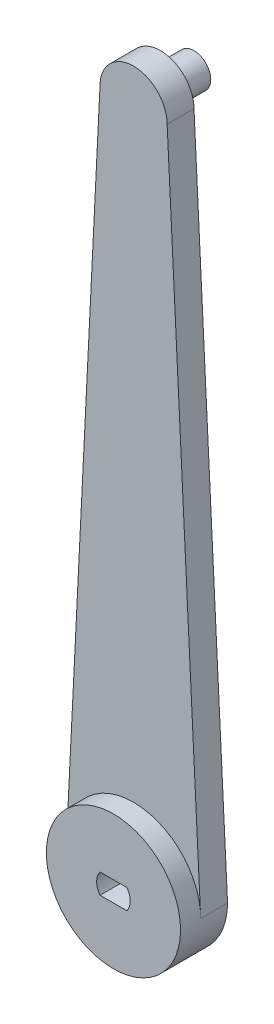
ISO-10303-21;
HEADER;
FILE_DESCRIPTION(('STEP AP214'),'2;1');
FILE_NAME('part.step','',(''),(''),'','','');
FILE_SCHEMA(('AUTOMOTIVE_DESIGN { 1 0 10303 214 1 1 1 1 }'));
ENDSEC;
DATA;
#1=APPLICATION_CONTEXT('core data for automotive mechanical design processes');
#2=APPLICATION_PROTOCOL_DEFINITION('international standard','automotive_design',2000,#1);
#3=PRODUCT_CONTEXT('',#1,'mechanical');
#4=PRODUCT('Part','Part','',(#3));
#5=PRODUCT_RELATED_PRODUCT_CATEGORY('part','',(#4));
#6=PRODUCT_DEFINITION_FORMATION('','',#4);
#7=PRODUCT_DEFINITION_CONTEXT('part definition',#1,'design');
#8=PRODUCT_DEFINITION('design','',#6,#7);
#9=PRODUCT_DEFINITION_SHAPE('','',#8);
#10=(LENGTH_UNIT() NAMED_UNIT(*) SI_UNIT(.MILLI.,.METRE.));
#11=(NAMED_UNIT(*) PLANE_ANGLE_UNIT() SI_UNIT($,.RADIAN.));
#12=(NAMED_UNIT(*) SI_UNIT($,.STERADIAN.) SOLID_ANGLE_UNIT());
#13=UNCERTAINTY_MEASURE_WITH_UNIT(LENGTH_MEASURE(1.E-05),#10,'distance_accuracy_value','');
#14=(GEOMETRIC_REPRESENTATION_CONTEXT(3) GLOBAL_UNCERTAINTY_ASSIGNED_CONTEXT((#13)) GLOBAL_UNIT_ASSIGNED_CONTEXT((#10,
#11,#12)) REPRESENTATION_CONTEXT('',''));
#15=CARTESIAN_POINT('',(0.,0.,0.));
#16=DIRECTION('',(0.,0.,1.));
#17=DIRECTION('',(1.,0.,0.));
#18=AXIS2_PLACEMENT_3D('',#15,#16,#17);
#19=CARTESIAN_POINT('',(0.,0.,0.));
#20=DIRECTION('',(0.,0.,1.));
#21=DIRECTION('',(1.,0.,0.));
#22=AXIS2_PLACEMENT_3D('',#19,#20,#21);
#23=PLANE('',#22);
#24=CARTESIAN_POINT('',(0.,100.,0.));
#25=DIRECTION('',(0.,0.,1.));
#26=DIRECTION('',(1.,0.,0.));
#27=AXIS2_PLACEMENT_3D('',#24,#25,#26);
#28=CIRCLE('',#27,2.5);
#29=CARTESIAN_POINT('',(2.5,100.,0.));
#30=VERTEX_POINT('',#29);
#31=EDGE_CURVE('E138',#30,#30,#28,.T.);
#32=ORIENTED_EDGE('',*,*,#31,.T.);
#33=EDGE_LOOP('',(#32));
#34=FACE_BOUND('',#33,.T.);
#35=CARTESIAN_POINT('',(0.,0.,0.));
#36=DIRECTION('',(0.,0.,1.));
#37=DIRECTION('',(1.,0.,0.));
#38=AXIS2_PLACEMENT_3D('',#35,#36,#37);
#39=CIRCLE('',#38,10.);
#40=CARTESIAN_POINT('',(-10.,0.,0.));
#41=VERTEX_POINT('',#40);
#42=CARTESIAN_POINT('',(10.,0.,0.));
#43=VERTEX_POINT('',#42);
#44=EDGE_CURVE('E161',#41,#43,#39,.T.);
#45=ORIENTED_EDGE('',*,*,#44,.F.);
#46=DIRECTION('',(-0.0499376169438922,-0.998752338877845,0.));
#47=VECTOR('',#46,1.);
#48=CARTESIAN_POINT('',(-10.,0.,0.));
#49=LINE('',#48,#47);
#50=CARTESIAN_POINT('',(-5.,100.,0.));
#51=VERTEX_POINT('',#50);
#52=EDGE_CURVE('E190',#51,#41,#49,.T.);
#53=ORIENTED_EDGE('',*,*,#52,.F.);
#54=CARTESIAN_POINT('',(0.,100.,0.));
#55=DIRECTION('',(0.,0.,1.));
#56=DIRECTION('',(1.,0.,0.));
#57=AXIS2_PLACEMENT_3D('',#54,#55,#56);
#58=CIRCLE('',#57,5.);
#59=CARTESIAN_POINT('',(5.,100.,0.));
#60=VERTEX_POINT('',#59);
#61=EDGE_CURVE('E187',#60,#51,#58,.T.);
#62=ORIENTED_EDGE('',*,*,#61,.F.);
#63=DIRECTION('',(-0.0499376169438922,0.998752338877845,0.));
#64=VECTOR('',#63,1.);
#65=CARTESIAN_POINT('',(5.,100.,0.));
#66=LINE('',#65,#64);
#67=EDGE_CURVE('E184',#43,#60,#66,.T.);
#68=ORIENTED_EDGE('',*,*,#67,.F.);
#69=EDGE_LOOP('',(#45,#53,#62,#68));
#70=FACE_BOUND('',#69,.T.);
#71=CARTESIAN_POINT('',(0.,0.,0.));
#72=DIRECTION('',(0.,0.,1.));
#73=DIRECTION('',(1.,0.,0.));
#74=AXIS2_PLACEMENT_3D('',#71,#72,#73);
#75=CIRCLE('',#74,2.5);
#76=CARTESIAN_POINT('',(-2.,1.5,0.));
#77=VERTEX_POINT('',#76);
#78=CARTESIAN_POINT('',(-2.,-1.5,0.));
#79=VERTEX_POINT('',#78);
#80=EDGE_CURVE('E61',#77,#79,#75,.T.);
#81=ORIENTED_EDGE('',*,*,#80,.T.);
#82=DIRECTION('',(1.,0.,0.));
#83=VECTOR('',#82,1.);
#84=CARTESIAN_POINT('',(-2.,-1.5,0.));
#85=LINE('',#84,#83);
#86=CARTESIAN_POINT('',(2.,-1.5,0.));
#87=VERTEX_POINT('',#86);
#88=EDGE_CURVE('E126',#79,#87,#85,.T.);
#89=ORIENTED_EDGE('',*,*,#88,.T.);
#90=CARTESIAN_POINT('',(0.,0.,0.));
#91=DIRECTION('',(0.,0.,1.));
#92=DIRECTION('',(1.,0.,0.));
#93=AXIS2_PLACEMENT_3D('',#90,#91,#92);
#94=CIRCLE('',#93,2.5);
#95=CARTESIAN_POINT('',(2.,1.5,0.));
#96=VERTEX_POINT('',#95);
#97=EDGE_CURVE('E133',#87,#96,#94,.T.);
#98=ORIENTED_EDGE('',*,*,#97,.T.);
#99=DIRECTION('',(-1.,0.,0.));
#100=VECTOR('',#99,1.);
#101=CARTESIAN_POINT('',(-2.,1.5,0.));
#102=LINE('',#101,#100);
#103=EDGE_CURVE('E136',#96,#77,#102,.T.);
#104=ORIENTED_EDGE('',*,*,#103,.T.);
#105=EDGE_LOOP('',(#81,#89,#98,#104));
#106=FACE_BOUND('',#105,.T.);
#107=ADVANCED_FACE('F45',(#34,#70,#106),#23,.F.);
#108=CARTESIAN_POINT('',(0.,0.,7.));
#109=DIRECTION('',(0.,0.,1.));
#110=DIRECTION('',(1.,0.,0.));
#111=AXIS2_PLACEMENT_3D('',#108,#109,#110);
#112=PLANE('',#111);
#113=CARTESIAN_POINT('',(0.,0.,7.));
#114=DIRECTION('',(0.,0.,1.));
#115=DIRECTION('',(1.,0.,0.));
#116=AXIS2_PLACEMENT_3D('',#113,#114,#115);
#117=CIRCLE('',#116,10.);
#118=CARTESIAN_POINT('',(10.,0.,7.));
#119=VERTEX_POINT('',#118);
#120=EDGE_CURVE('E157',#119,#119,#117,.T.);
#121=ORIENTED_EDGE('',*,*,#120,.T.);
#122=EDGE_LOOP('',(#121));
#123=FACE_BOUND('',#122,.T.);
#124=DIRECTION('',(-1.,0.,0.));
#125=VECTOR('',#124,1.);
#126=CARTESIAN_POINT('',(0.,-1.5,7.));
#127=LINE('',#126,#125);
#128=CARTESIAN_POINT('',(2.,-1.5,7.));
#129=VERTEX_POINT('',#128);
#130=CARTESIAN_POINT('',(-2.,-1.5,7.));
#131=VERTEX_POINT('',#130);
#132=EDGE_CURVE('E54',#129,#131,#127,.T.);
#133=ORIENTED_EDGE('',*,*,#132,.T.);
#134=CARTESIAN_POINT('',(0.,0.,7.));
#135=DIRECTION('',(0.,0.,1.));
#136=DIRECTION('',(1.,0.,0.));
#137=AXIS2_PLACEMENT_3D('',#134,#135,#136);
#138=CIRCLE('',#137,2.5);
#139=CARTESIAN_POINT('',(-2.,1.5,7.));
#140=VERTEX_POINT('',#139);
#141=EDGE_CURVE('E11',#131,#140,#138,.F.);
#142=ORIENTED_EDGE('',*,*,#141,.T.);
#143=DIRECTION('',(1.,0.,0.));
#144=VECTOR('',#143,1.);
#145=CARTESIAN_POINT('',(0.,1.5,7.));
#146=LINE('',#145,#144);
#147=CARTESIAN_POINT('',(2.,1.5,7.));
#148=VERTEX_POINT('',#147);
#149=EDGE_CURVE('E208',#140,#148,#146,.T.);
#150=ORIENTED_EDGE('',*,*,#149,.T.);
#151=CARTESIAN_POINT('',(0.,0.,7.));
#152=DIRECTION('',(0.,0.,1.));
#153=DIRECTION('',(1.,0.,0.));
#154=AXIS2_PLACEMENT_3D('',#151,#152,#153);
#155=CIRCLE('',#154,2.5);
#156=EDGE_CURVE('E212',#148,#129,#155,.F.);
#157=ORIENTED_EDGE('',*,*,#156,.T.);
#158=EDGE_LOOP('',(#133,#142,#150,#157));
#159=FACE_BOUND('',#158,.T.);
#160=ADVANCED_FACE('F217',(#123,#159),#112,.T.);
#161=CARTESIAN_POINT('',(0.,0.,4.));
#162=DIRECTION('',(0.,0.,-1.));
#163=DIRECTION('',(-1.,0.,0.));
#164=AXIS2_PLACEMENT_3D('',#161,#162,#163);
#165=CYLINDRICAL_SURFACE('',#164,10.);
#166=ORIENTED_EDGE('',*,*,#44,.T.);
#167=DIRECTION('',(0.,0.,-1.));
#168=VECTOR('',#167,1.);
#169=CARTESIAN_POINT('',(10.,0.,4.));
#170=LINE('',#169,#168);
#171=CARTESIAN_POINT('',(10.,0.,4.));
#172=VERTEX_POINT('',#171);
#173=EDGE_CURVE('E204',#172,#43,#170,.T.);
#174=ORIENTED_EDGE('',*,*,#173,.F.);
#175=CARTESIAN_POINT('',(0.,0.,4.));
#176=DIRECTION('',(0.,0.,1.));
#177=DIRECTION('',(1.,0.,0.));
#178=AXIS2_PLACEMENT_3D('',#175,#176,#177);
#179=CIRCLE('',#178,10.);
#180=CARTESIAN_POINT('',(9.9501246882793,0.997506234414003,4.));
#181=VERTEX_POINT('',#180);
#182=EDGE_CURVE('E162',#172,#181,#179,.T.);
#183=ORIENTED_EDGE('',*,*,#182,.T.);
#184=CARTESIAN_POINT('',(-9.9501246882793,0.997506234414003,4.));
#185=VERTEX_POINT('',#184);
#186=EDGE_CURVE('E166',#181,#185,#179,.T.);
#187=ORIENTED_EDGE('',*,*,#186,.T.);
#188=CARTESIAN_POINT('',(-10.,0.,4.));
#189=VERTEX_POINT('',#188);
#190=EDGE_CURVE('E122',#185,#189,#179,.T.);
#191=ORIENTED_EDGE('',*,*,#190,.T.);
#192=DIRECTION('',(0.,0.,-1.));
#193=VECTOR('',#192,1.);
#194=CARTESIAN_POINT('',(-10.,0.,4.));
#195=LINE('',#194,#193);
#196=EDGE_CURVE('E180',#189,#41,#195,.T.);
#197=ORIENTED_EDGE('',*,*,#196,.T.);
#198=EDGE_LOOP('',(#166,#174,#183,#187,#191,#197));
#199=FACE_BOUND('',#198,.T.);
#200=ORIENTED_EDGE('',*,*,#120,.F.);
#201=EDGE_LOOP('',(#200));
#202=FACE_BOUND('',#201,.T.);
#203=ADVANCED_FACE('F47',(#199,#202),#165,.T.);
#204=CARTESIAN_POINT('',(5.,100.,4.));
#205=DIRECTION('',(-0.998752338877845,-0.0499376169438922,0.));
#206=DIRECTION('',(0.0499376169438922,-0.998752338877845,0.));
#207=AXIS2_PLACEMENT_3D('',#204,#205,#206);
#208=PLANE('',#207);
#209=ORIENTED_EDGE('',*,*,#67,.T.);
#210=DIRECTION('',(0.,0.,-1.));
#211=VECTOR('',#210,1.);
#212=CARTESIAN_POINT('',(5.,100.,4.));
#213=LINE('',#212,#211);
#214=CARTESIAN_POINT('',(5.,100.,4.));
#215=VERTEX_POINT('',#214);
#216=EDGE_CURVE('E200',#215,#60,#213,.T.);
#217=ORIENTED_EDGE('',*,*,#216,.F.);
#218=DIRECTION('',(-0.0499376169438922,0.998752338877845,0.));
#219=VECTOR('',#218,1.);
#220=CARTESIAN_POINT('',(5.,100.,4.));
#221=LINE('',#220,#219);
#222=EDGE_CURVE('E172',#181,#215,#221,.T.);
#223=ORIENTED_EDGE('',*,*,#222,.F.);
#224=EDGE_CURVE('E167',#172,#181,#221,.T.);
#225=ORIENTED_EDGE('',*,*,#224,.F.);
#226=ORIENTED_EDGE('',*,*,#173,.T.);
#227=EDGE_LOOP('',(#209,#217,#223,#225,#226));
#228=FACE_BOUND('',#227,.T.);
#229=ADVANCED_FACE('F252',(#228),#208,.F.);
#230=CARTESIAN_POINT('',(0.,100.,4.));
#231=DIRECTION('',(0.,0.,-1.));
#232=DIRECTION('',(-1.,0.,0.));
#233=AXIS2_PLACEMENT_3D('',#230,#231,#232);
#234=CYLINDRICAL_SURFACE('',#233,5.);
#235=ORIENTED_EDGE('',*,*,#61,.T.);
#236=DIRECTION('',(0.,0.,-1.));
#237=VECTOR('',#236,1.);
#238=CARTESIAN_POINT('',(-5.,100.,4.));
#239=LINE('',#238,#237);
#240=CARTESIAN_POINT('',(-5.,100.,4.));
#241=VERTEX_POINT('',#240);
#242=EDGE_CURVE('E196',#241,#51,#239,.T.);
#243=ORIENTED_EDGE('',*,*,#242,.F.);
#244=CARTESIAN_POINT('',(0.,100.,4.));
#245=DIRECTION('',(0.,0.,1.));
#246=DIRECTION('',(1.,0.,0.));
#247=AXIS2_PLACEMENT_3D('',#244,#245,#246);
#248=CIRCLE('',#247,5.);
#249=EDGE_CURVE('E171',#215,#241,#248,.T.);
#250=ORIENTED_EDGE('',*,*,#249,.F.);
#251=ORIENTED_EDGE('',*,*,#216,.T.);
#252=EDGE_LOOP('',(#235,#243,#250,#251));
#253=FACE_BOUND('',#252,.T.);
#254=ADVANCED_FACE('F249',(#253),#234,.T.);
#255=CARTESIAN_POINT('',(-10.,0.,4.));
#256=DIRECTION('',(0.998752338877845,-0.0499376169438922,0.));
#257=DIRECTION('',(0.0499376169438922,0.998752338877845,0.));
#258=AXIS2_PLACEMENT_3D('',#255,#256,#257);
#259=PLANE('',#258);
#260=ORIENTED_EDGE('',*,*,#52,.T.);
#261=ORIENTED_EDGE('',*,*,#196,.F.);
#262=DIRECTION('',(-0.0499376169438922,-0.998752338877845,0.));
#263=VECTOR('',#262,1.);
#264=CARTESIAN_POINT('',(-10.,0.,4.));
#265=LINE('',#264,#263);
#266=EDGE_CURVE('E175',#185,#189,#265,.T.);
#267=ORIENTED_EDGE('',*,*,#266,.F.);
#268=EDGE_CURVE('E176',#241,#185,#265,.T.);
#269=ORIENTED_EDGE('',*,*,#268,.F.);
#270=ORIENTED_EDGE('',*,*,#242,.T.);
#271=EDGE_LOOP('',(#260,#261,#267,#269,#270));
#272=FACE_BOUND('',#271,.T.);
#273=ADVANCED_FACE('F246',(#272),#259,.F.);
#274=CARTESIAN_POINT('',(0.,0.,4.));
#275=DIRECTION('',(0.,0.,1.));
#276=DIRECTION('',(1.,0.,0.));
#277=AXIS2_PLACEMENT_3D('',#274,#275,#276);
#278=PLANE('',#277);
#279=ORIENTED_EDGE('',*,*,#186,.F.);
#280=ORIENTED_EDGE('',*,*,#222,.T.);
#281=ORIENTED_EDGE('',*,*,#249,.T.);
#282=ORIENTED_EDGE('',*,*,#268,.T.);
#283=EDGE_LOOP('',(#279,#280,#281,#282));
#284=FACE_BOUND('',#283,.T.);
#285=ADVANCED_FACE('F244',(#284),#278,.T.);
#286=CARTESIAN_POINT('',(0.,0.,4.));
#287=DIRECTION('',(0.,0.,1.));
#288=DIRECTION('',(1.,0.,0.));
#289=AXIS2_PLACEMENT_3D('',#286,#287,#288);
#290=PLANE('',#289);
#291=ORIENTED_EDGE('',*,*,#182,.F.);
#292=ORIENTED_EDGE('',*,*,#224,.T.);
#293=EDGE_LOOP('',(#291,#292));
#294=FACE_BOUND('',#293,.T.);
#295=ADVANCED_FACE('F282',(#294),#290,.F.);
#296=ORIENTED_EDGE('',*,*,#190,.F.);
#297=ORIENTED_EDGE('',*,*,#266,.T.);
#298=EDGE_LOOP('',(#296,#297));
#299=FACE_BOUND('',#298,.T.);
#300=ADVANCED_FACE('F284',(#299),#290,.F.);
#301=CARTESIAN_POINT('',(0.,0.,11.));
#302=DIRECTION('',(0.,0.,-1.));
#303=DIRECTION('',(-1.,0.,0.));
#304=AXIS2_PLACEMENT_3D('',#301,#302,#303);
#305=CYLINDRICAL_SURFACE('',#304,2.5);
#306=DIRECTION('',(0.,0.,-1.));
#307=VECTOR('',#306,1.);
#308=CARTESIAN_POINT('',(-2.,-1.5,11.));
#309=LINE('',#308,#307);
#310=EDGE_CURVE('E116',#131,#79,#309,.T.);
#311=ORIENTED_EDGE('',*,*,#310,.T.);
#312=ORIENTED_EDGE('',*,*,#80,.F.);
#313=DIRECTION('',(0.,0.,-1.));
#314=VECTOR('',#313,1.);
#315=CARTESIAN_POINT('',(-2.,1.5,11.));
#316=LINE('',#315,#314);
#317=EDGE_CURVE('E150',#140,#77,#316,.T.);
#318=ORIENTED_EDGE('',*,*,#317,.F.);
#319=ORIENTED_EDGE('',*,*,#141,.F.);
#320=EDGE_LOOP('',(#311,#312,#318,#319));
#321=FACE_BOUND('',#320,.T.);
#322=ADVANCED_FACE('F118',(#321),#305,.F.);
#323=CARTESIAN_POINT('',(-2.,-1.5,11.));
#324=DIRECTION('',(0.,1.,0.));
#325=DIRECTION('',(0.,0.,1.));
#326=AXIS2_PLACEMENT_3D('',#323,#324,#325);
#327=PLANE('',#326);
#328=DIRECTION('',(0.,0.,-1.));
#329=VECTOR('',#328,1.);
#330=CARTESIAN_POINT('',(2.,-1.5,11.));
#331=LINE('',#330,#329);
#332=EDGE_CURVE('E123',#129,#87,#331,.T.);
#333=ORIENTED_EDGE('',*,*,#332,.T.);
#334=ORIENTED_EDGE('',*,*,#88,.F.);
#335=ORIENTED_EDGE('',*,*,#310,.F.);
#336=ORIENTED_EDGE('',*,*,#132,.F.);
#337=EDGE_LOOP('',(#333,#334,#335,#336));
#338=FACE_BOUND('',#337,.T.);
#339=ADVANCED_FACE('F127',(#338),#327,.T.);
#340=CARTESIAN_POINT('',(0.,0.,11.));
#341=DIRECTION('',(0.,0.,-1.));
#342=DIRECTION('',(-1.,0.,0.));
#343=AXIS2_PLACEMENT_3D('',#340,#341,#342);
#344=CYLINDRICAL_SURFACE('',#343,2.5);
#345=DIRECTION('',(0.,0.,-1.));
#346=VECTOR('',#345,1.);
#347=CARTESIAN_POINT('',(2.,1.5,11.));
#348=LINE('',#347,#346);
#349=EDGE_CURVE('E69',#148,#96,#348,.T.);
#350=ORIENTED_EDGE('',*,*,#349,.T.);
#351=ORIENTED_EDGE('',*,*,#97,.F.);
#352=ORIENTED_EDGE('',*,*,#332,.F.);
#353=ORIENTED_EDGE('',*,*,#156,.F.);
#354=EDGE_LOOP('',(#350,#351,#352,#353));
#355=FACE_BOUND('',#354,.T.);
#356=ADVANCED_FACE('F219',(#355),#344,.F.);
#357=CARTESIAN_POINT('',(-2.,1.5,11.));
#358=DIRECTION('',(0.,-1.,0.));
#359=DIRECTION('',(0.,0.,-1.));
#360=AXIS2_PLACEMENT_3D('',#357,#358,#359);
#361=PLANE('',#360);
#362=ORIENTED_EDGE('',*,*,#317,.T.);
#363=ORIENTED_EDGE('',*,*,#103,.F.);
#364=ORIENTED_EDGE('',*,*,#349,.F.);
#365=ORIENTED_EDGE('',*,*,#149,.F.);
#366=EDGE_LOOP('',(#362,#363,#364,#365));
#367=FACE_BOUND('',#366,.T.);
#368=ADVANCED_FACE('F220',(#367),#361,.T.);
#369=CARTESIAN_POINT('',(0.,100.,-5.));
#370=DIRECTION('',(0.,0.,1.));
#371=DIRECTION('',(1.,0.,0.));
#372=AXIS2_PLACEMENT_3D('',#369,#370,#371);
#373=CYLINDRICAL_SURFACE('',#372,2.5);
#374=CARTESIAN_POINT('',(0.,100.,-5.));
#375=DIRECTION('',(0.,0.,1.));
#376=DIRECTION('',(1.,0.,0.));
#377=AXIS2_PLACEMENT_3D('',#374,#375,#376);
#378=CIRCLE('',#377,2.5);
#379=CARTESIAN_POINT('',(2.5,100.,-5.));
#380=VERTEX_POINT('',#379);
#381=EDGE_CURVE('E142',#380,#380,#378,.T.);
#382=ORIENTED_EDGE('',*,*,#381,.T.);
#383=EDGE_LOOP('',(#382));
#384=FACE_BOUND('',#383,.T.);
#385=ORIENTED_EDGE('',*,*,#31,.F.);
#386=EDGE_LOOP('',(#385));
#387=FACE_BOUND('',#386,.T.);
#388=ADVANCED_FACE('F222',(#384,#387),#373,.T.);
#389=CARTESIAN_POINT('',(0.,100.,-5.));
#390=DIRECTION('',(0.,0.,1.));
#391=DIRECTION('',(1.,0.,0.));
#392=AXIS2_PLACEMENT_3D('',#389,#390,#391);
#393=PLANE('',#392);
#394=ORIENTED_EDGE('',*,*,#381,.F.);
#395=EDGE_LOOP('',(#394));
#396=FACE_BOUND('',#395,.T.);
#397=ADVANCED_FACE('F229',(#396),#393,.F.);
#398=CLOSED_SHELL('',(#107,#160,#203,#229,#254,#273,#285,#295,#300,#322,#339,#356,#368,#388,#397));
#399=MANIFOLD_SOLID_BREP('B2',#398);
#400=ADVANCED_BREP_SHAPE_REPRESENTATION('',(#18,#399),#14);
#401=SHAPE_DEFINITION_REPRESENTATION(#9,#400);
ENDSEC;
END-ISO-10303-21;
